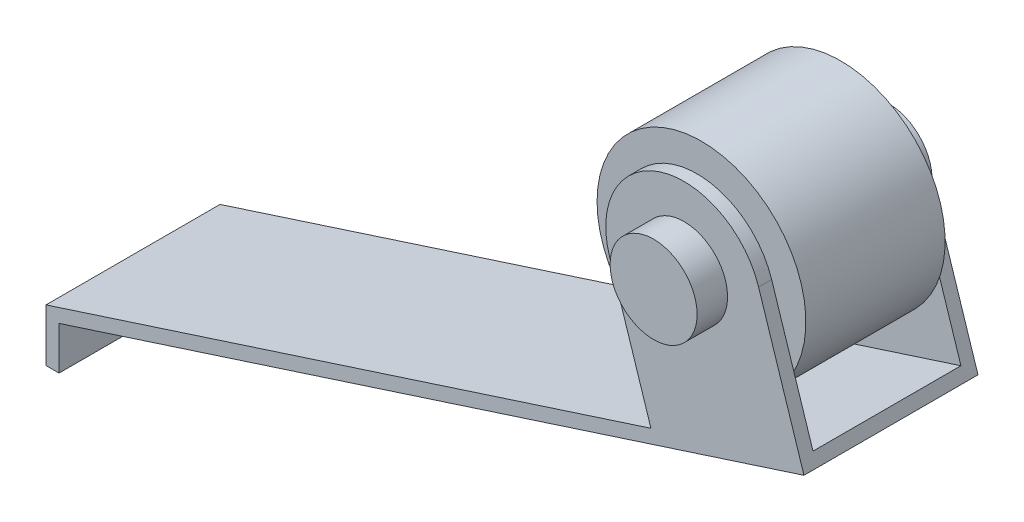
ISO-10303-21;
HEADER;
FILE_DESCRIPTION(('STEP AP214'),'2;1');
FILE_NAME('part.step','',(''),(''),'','','');
FILE_SCHEMA(('AUTOMOTIVE_DESIGN { 1 0 10303 214 1 1 1 1 }'));
ENDSEC;
DATA;
#1=APPLICATION_CONTEXT('core data for automotive mechanical design processes');
#2=APPLICATION_PROTOCOL_DEFINITION('international standard','automotive_design',2000,#1);
#3=PRODUCT_CONTEXT('',#1,'mechanical');
#4=PRODUCT('Part','Part','',(#3));
#5=PRODUCT_RELATED_PRODUCT_CATEGORY('part','',(#4));
#6=PRODUCT_DEFINITION_FORMATION('','',#4);
#7=PRODUCT_DEFINITION_CONTEXT('part definition',#1,'design');
#8=PRODUCT_DEFINITION('design','',#6,#7);
#9=PRODUCT_DEFINITION_SHAPE('','',#8);
#10=(LENGTH_UNIT() NAMED_UNIT(*) SI_UNIT(.MILLI.,.METRE.));
#11=(NAMED_UNIT(*) PLANE_ANGLE_UNIT() SI_UNIT($,.RADIAN.));
#12=(NAMED_UNIT(*) SI_UNIT($,.STERADIAN.) SOLID_ANGLE_UNIT());
#13=UNCERTAINTY_MEASURE_WITH_UNIT(LENGTH_MEASURE(1.E-05),#10,'distance_accuracy_value','');
#14=(GEOMETRIC_REPRESENTATION_CONTEXT(3) GLOBAL_UNCERTAINTY_ASSIGNED_CONTEXT((#13)) GLOBAL_UNIT_ASSIGNED_CONTEXT((#10,
#11,#12)) REPRESENTATION_CONTEXT('',''));
#15=CARTESIAN_POINT('',(0.,0.,0.));
#16=DIRECTION('',(0.,0.,1.));
#17=DIRECTION('',(1.,0.,0.));
#18=AXIS2_PLACEMENT_3D('',#15,#16,#17);
#19=CARTESIAN_POINT('',(14.3663156394455,9.2,-2.));
#20=DIRECTION('',(0.,0.,-1.));
#21=DIRECTION('',(-1.,0.,0.));
#22=AXIS2_PLACEMENT_3D('',#19,#20,#21);
#23=PLANE('',#22);
#24=DIRECTION('',(0.,1.,0.));
#25=VECTOR('',#24,1.);
#26=CARTESIAN_POINT('',(0.,0.,-2.));
#27=LINE('',#26,#25);
#28=CARTESIAN_POINT('',(0.,0.,-2.));
#29=VERTEX_POINT('',#28);
#30=CARTESIAN_POINT('',(0.,0.99,-2.));
#31=VERTEX_POINT('',#30);
#32=EDGE_CURVE('E139',#29,#31,#27,.T.);
#33=ORIENTED_EDGE('',*,*,#32,.F.);
#34=DIRECTION('',(1.,0.,0.));
#35=VECTOR('',#34,1.);
#36=CARTESIAN_POINT('',(0.,0.,-2.));
#37=LINE('',#36,#35);
#38=CARTESIAN_POINT('',(-0.3,0.,-2.));
#39=VERTEX_POINT('',#38);
#40=EDGE_CURVE('E158',#39,#29,#37,.T.);
#41=ORIENTED_EDGE('',*,*,#40,.F.);
#42=DIRECTION('',(0.,-1.,0.));
#43=VECTOR('',#42,1.);
#44=CARTESIAN_POINT('',(-0.3,1.20828821372089,-2.));
#45=LINE('',#44,#43);
#46=CARTESIAN_POINT('',(-0.3,1.20828821372089,-2.));
#47=VERTEX_POINT('',#46);
#48=EDGE_CURVE('E156',#47,#39,#45,.T.);
#49=ORIENTED_EDGE('',*,*,#48,.F.);
#50=DIRECTION('',(-0.951494163295912,-0.307666795760955,0.));
#51=VECTOR('',#50,1.);
#52=CARTESIAN_POINT('',(13.6048484329192,5.70443787803314,-2.));
#53=LINE('',#52,#51);
#54=CARTESIAN_POINT('',(13.6048484329192,5.70443787803314,-2.));
#55=VERTEX_POINT('',#54);
#56=EDGE_CURVE('E154',#55,#47,#53,.T.);
#57=ORIENTED_EDGE('',*,*,#56,.F.);
#58=DIRECTION('',(0.307666795760955,-0.951494163295912,0.));
#59=VECTOR('',#58,1.);
#60=CARTESIAN_POINT('',(13.6048484329192,5.70443787803314,-2.));
#61=LINE('',#60,#59);
#62=CARTESIAN_POINT('',(12.6536261455129,8.64619976763028,-2.));
#63=VERTEX_POINT('',#62);
#64=EDGE_CURVE('E151',#63,#55,#61,.T.);
#65=ORIENTED_EDGE('',*,*,#64,.F.);
#66=CARTESIAN_POINT('',(14.3663156394455,9.2,-2.));
#67=DIRECTION('',(0.,0.,1.));
#68=DIRECTION('',(-1.,0.,0.));
#69=AXIS2_PLACEMENT_3D('',#66,#67,#68);
#70=CIRCLE('',#69,1.8);
#71=CARTESIAN_POINT('',(16.0790051333782,9.75380023236972,-2.));
#72=VERTEX_POINT('',#71);
#73=EDGE_CURVE('E148',#72,#63,#70,.T.);
#74=ORIENTED_EDGE('',*,*,#73,.F.);
#75=DIRECTION('',(-0.307666795760956,0.951494163295912,0.));
#76=VECTOR('',#75,1.);
#77=CARTESIAN_POINT('',(16.0790051333782,9.75380023236972,-2.));
#78=LINE('',#77,#76);
#79=CARTESIAN_POINT('',(17.1225274595128,6.5265900937838,-2.));
#80=VERTEX_POINT('',#79);
#81=EDGE_CURVE('E146',#80,#72,#78,.T.);
#82=ORIENTED_EDGE('',*,*,#81,.F.);
#83=DIRECTION('',(0.951494163295912,0.307666795760955,0.));
#84=VECTOR('',#83,1.);
#85=CARTESIAN_POINT('',(0.,0.99,-2.));
#86=LINE('',#85,#84);
#87=EDGE_CURVE('E144',#31,#80,#86,.T.);
#88=ORIENTED_EDGE('',*,*,#87,.F.);
#89=EDGE_LOOP('',(#33,#41,#49,#57,#65,#74,#82,#88));
#90=FACE_BOUND('',#89,.T.);
#91=CARTESIAN_POINT('',(14.3663156394455,9.2,-2.));
#92=DIRECTION('',(0.,0.,-1.));
#93=DIRECTION('',(-1.,0.,0.));
#94=AXIS2_PLACEMENT_3D('',#91,#92,#93);
#95=CIRCLE('',#94,1.);
#96=CARTESIAN_POINT('',(13.3663156394455,9.2,-2.));
#97=VERTEX_POINT('',#96);
#98=EDGE_CURVE('E217',#97,#97,#95,.F.);
#99=ORIENTED_EDGE('',*,*,#98,.T.);
#100=EDGE_LOOP('',(#99));
#101=FACE_BOUND('',#100,.T.);
#102=ADVANCED_FACE('F17',(#90,#101),#23,.T.);
#103=CARTESIAN_POINT('',(14.3663156394455,9.2,-1.7));
#104=DIRECTION('',(0.,0.,-1.));
#105=DIRECTION('',(-1.,0.,0.));
#106=AXIS2_PLACEMENT_3D('',#103,#104,#105);
#107=PLANE('',#106);
#108=DIRECTION('',(0.307666795760955,-0.951494163295912,0.));
#109=VECTOR('',#108,1.);
#110=CARTESIAN_POINT('',(12.6536261455129,8.64619976763028,-1.7));
#111=LINE('',#110,#109);
#112=CARTESIAN_POINT('',(12.6536261455129,8.64619976763028,-1.7));
#113=VERTEX_POINT('',#112);
#114=CARTESIAN_POINT('',(13.6048484329192,5.70443787803314,-1.7));
#115=VERTEX_POINT('',#114);
#116=EDGE_CURVE('E34',#113,#115,#111,.T.);
#117=ORIENTED_EDGE('',*,*,#116,.T.);
#118=DIRECTION('',(0.951494163295912,0.307666795760955,0.));
#119=VECTOR('',#118,1.);
#120=CARTESIAN_POINT('',(17.0302274207844,6.81203834277258,-1.7));
#121=LINE('',#120,#119);
#122=CARTESIAN_POINT('',(17.0302274207844,6.81203834277258,-1.7));
#123=VERTEX_POINT('',#122);
#124=EDGE_CURVE('E111',#115,#123,#121,.T.);
#125=ORIENTED_EDGE('',*,*,#124,.T.);
#126=DIRECTION('',(-0.307666795760955,0.951494163295912,0.));
#127=VECTOR('',#126,1.);
#128=CARTESIAN_POINT('',(17.0302274207844,6.81203834277258,-1.7));
#129=LINE('',#128,#127);
#130=CARTESIAN_POINT('',(16.0790051333782,9.75380023236972,-1.7));
#131=VERTEX_POINT('',#130);
#132=EDGE_CURVE('E123',#123,#131,#129,.T.);
#133=ORIENTED_EDGE('',*,*,#132,.T.);
#134=CARTESIAN_POINT('',(14.3663156394455,9.2,-1.7));
#135=DIRECTION('',(0.,0.,-1.));
#136=DIRECTION('',(-1.,0.,0.));
#137=AXIS2_PLACEMENT_3D('',#134,#135,#136);
#138=CIRCLE('',#137,1.8);
#139=EDGE_CURVE('E130',#131,#113,#138,.F.);
#140=ORIENTED_EDGE('',*,*,#139,.T.);
#141=EDGE_LOOP('',(#117,#125,#133,#140));
#142=FACE_BOUND('',#141,.T.);
#143=CARTESIAN_POINT('',(14.3663156394455,9.2,-1.7));
#144=DIRECTION('',(0.,0.,-1.));
#145=DIRECTION('',(-1.,0.,0.));
#146=AXIS2_PLACEMENT_3D('',#143,#144,#145);
#147=CIRCLE('',#146,1.);
#148=CARTESIAN_POINT('',(13.3663156394455,9.2,-1.7));
#149=VERTEX_POINT('',#148);
#150=EDGE_CURVE('E11',#149,#149,#147,.F.);
#151=ORIENTED_EDGE('',*,*,#150,.F.);
#152=EDGE_LOOP('',(#151));
#153=FACE_BOUND('',#152,.T.);
#154=ADVANCED_FACE('F121',(#142,#153),#107,.F.);
#155=CARTESIAN_POINT('',(14.3663156394455,9.2,-1.6));
#156=DIRECTION('',(0.,0.,-1.));
#157=DIRECTION('',(-1.,0.,0.));
#158=AXIS2_PLACEMENT_3D('',#155,#156,#157);
#159=PLANE('',#158);
#160=CARTESIAN_POINT('',(14.3663156394455,9.2,-1.6));
#161=DIRECTION('',(0.,0.,-1.));
#162=DIRECTION('',(-1.,0.,0.));
#163=AXIS2_PLACEMENT_3D('',#160,#161,#162);
#164=CIRCLE('',#163,2.4);
#165=CARTESIAN_POINT('',(11.9663156394455,9.2,-1.6));
#166=VERTEX_POINT('',#165);
#167=EDGE_CURVE('E211',#166,#166,#164,.T.);
#168=ORIENTED_EDGE('',*,*,#167,.T.);
#169=EDGE_LOOP('',(#168));
#170=FACE_BOUND('',#169,.T.);
#171=CARTESIAN_POINT('',(14.3663156394455,9.2,-1.6));
#172=DIRECTION('',(0.,0.,-1.));
#173=DIRECTION('',(-1.,0.,0.));
#174=AXIS2_PLACEMENT_3D('',#171,#172,#173);
#175=CIRCLE('',#174,1.);
#176=CARTESIAN_POINT('',(13.3663156394455,9.2,-1.6));
#177=VERTEX_POINT('',#176);
#178=EDGE_CURVE('E223',#177,#177,#175,.T.);
#179=ORIENTED_EDGE('',*,*,#178,.F.);
#180=EDGE_LOOP('',(#179));
#181=FACE_BOUND('',#180,.T.);
#182=ADVANCED_FACE('F230',(#170,#181),#159,.T.);
#183=CARTESIAN_POINT('',(14.3663156394455,9.2,2.));
#184=DIRECTION('',(0.,0.,-1.));
#185=DIRECTION('',(-1.,0.,0.));
#186=AXIS2_PLACEMENT_3D('',#183,#184,#185);
#187=PLANE('',#186);
#188=DIRECTION('',(0.,1.,0.));
#189=VECTOR('',#188,1.);
#190=CARTESIAN_POINT('',(0.,0.,2.));
#191=LINE('',#190,#189);
#192=CARTESIAN_POINT('',(0.,0.,2.));
#193=VERTEX_POINT('',#192);
#194=CARTESIAN_POINT('',(0.,0.99,2.));
#195=VERTEX_POINT('',#194);
#196=EDGE_CURVE('E160',#193,#195,#191,.T.);
#197=ORIENTED_EDGE('',*,*,#196,.T.);
#198=DIRECTION('',(0.951494163295912,0.307666795760955,0.));
#199=VECTOR('',#198,1.);
#200=CARTESIAN_POINT('',(0.,0.99,2.));
#201=LINE('',#200,#199);
#202=CARTESIAN_POINT('',(17.1225274595128,6.5265900937838,2.));
#203=VERTEX_POINT('',#202);
#204=EDGE_CURVE('E162',#195,#203,#201,.T.);
#205=ORIENTED_EDGE('',*,*,#204,.T.);
#206=DIRECTION('',(-0.307666795760956,0.951494163295912,0.));
#207=VECTOR('',#206,1.);
#208=CARTESIAN_POINT('',(16.0790051333782,9.75380023236972,2.));
#209=LINE('',#208,#207);
#210=CARTESIAN_POINT('',(16.0790051333782,9.75380023236972,2.));
#211=VERTEX_POINT('',#210);
#212=EDGE_CURVE('E164',#203,#211,#209,.T.);
#213=ORIENTED_EDGE('',*,*,#212,.T.);
#214=CARTESIAN_POINT('',(14.3663156394455,9.2,2.));
#215=DIRECTION('',(0.,0.,1.));
#216=DIRECTION('',(-1.,0.,0.));
#217=AXIS2_PLACEMENT_3D('',#214,#215,#216);
#218=CIRCLE('',#217,1.8);
#219=CARTESIAN_POINT('',(12.6536261455129,8.64619976763028,2.));
#220=VERTEX_POINT('',#219);
#221=EDGE_CURVE('E166',#211,#220,#218,.T.);
#222=ORIENTED_EDGE('',*,*,#221,.T.);
#223=DIRECTION('',(0.307666795760955,-0.951494163295912,0.));
#224=VECTOR('',#223,1.);
#225=CARTESIAN_POINT('',(13.6048484329192,5.70443787803314,2.));
#226=LINE('',#225,#224);
#227=CARTESIAN_POINT('',(13.6048484329192,5.70443787803314,2.));
#228=VERTEX_POINT('',#227);
#229=EDGE_CURVE('E168',#220,#228,#226,.T.);
#230=ORIENTED_EDGE('',*,*,#229,.T.);
#231=DIRECTION('',(-0.951494163295912,-0.307666795760955,0.));
#232=VECTOR('',#231,1.);
#233=CARTESIAN_POINT('',(13.6048484329192,5.70443787803314,2.));
#234=LINE('',#233,#232);
#235=CARTESIAN_POINT('',(-0.3,1.20828821372089,2.));
#236=VERTEX_POINT('',#235);
#237=EDGE_CURVE('E170',#228,#236,#234,.T.);
#238=ORIENTED_EDGE('',*,*,#237,.T.);
#239=DIRECTION('',(0.,-1.,0.));
#240=VECTOR('',#239,1.);
#241=CARTESIAN_POINT('',(-0.3,1.20828821372089,2.));
#242=LINE('',#241,#240);
#243=CARTESIAN_POINT('',(-0.3,0.,2.));
#244=VERTEX_POINT('',#243);
#245=EDGE_CURVE('E172',#236,#244,#242,.T.);
#246=ORIENTED_EDGE('',*,*,#245,.T.);
#247=DIRECTION('',(1.,0.,0.));
#248=VECTOR('',#247,1.);
#249=CARTESIAN_POINT('',(0.,0.,2.));
#250=LINE('',#249,#248);
#251=EDGE_CURVE('E42',#244,#193,#250,.T.);
#252=ORIENTED_EDGE('',*,*,#251,.T.);
#253=EDGE_LOOP('',(#197,#205,#213,#222,#230,#238,#246,#252));
#254=FACE_BOUND('',#253,.T.);
#255=CARTESIAN_POINT('',(14.3663156394455,9.2,2.));
#256=DIRECTION('',(0.,0.,-1.));
#257=DIRECTION('',(-1.,0.,0.));
#258=AXIS2_PLACEMENT_3D('',#255,#256,#257);
#259=CIRCLE('',#258,1.);
#260=CARTESIAN_POINT('',(13.3663156394455,9.2,2.));
#261=VERTEX_POINT('',#260);
#262=EDGE_CURVE('E26',#261,#261,#259,.F.);
#263=ORIENTED_EDGE('',*,*,#262,.F.);
#264=EDGE_LOOP('',(#263));
#265=FACE_BOUND('',#264,.T.);
#266=ADVANCED_FACE('F232',(#254,#265),#187,.F.);
#267=CARTESIAN_POINT('',(14.3663156394455,9.2,1.7));
#268=DIRECTION('',(0.,0.,-1.));
#269=DIRECTION('',(-1.,0.,0.));
#270=AXIS2_PLACEMENT_3D('',#267,#268,#269);
#271=PLANE('',#270);
#272=DIRECTION('',(-0.951494163295912,-0.307666795760955,0.));
#273=VECTOR('',#272,1.);
#274=CARTESIAN_POINT('',(17.0302274207844,6.81203834277258,1.7));
#275=LINE('',#274,#273);
#276=CARTESIAN_POINT('',(17.0302274207844,6.81203834277258,1.7));
#277=VERTEX_POINT('',#276);
#278=CARTESIAN_POINT('',(13.6048484329192,5.70443787803314,1.7));
#279=VERTEX_POINT('',#278);
#280=EDGE_CURVE('E114',#277,#279,#275,.T.);
#281=ORIENTED_EDGE('',*,*,#280,.T.);
#282=DIRECTION('',(-0.307666795760955,0.951494163295912,0.));
#283=VECTOR('',#282,1.);
#284=CARTESIAN_POINT('',(12.6536261455129,8.64619976763028,1.7));
#285=LINE('',#284,#283);
#286=CARTESIAN_POINT('',(12.6536261455129,8.64619976763028,1.7));
#287=VERTEX_POINT('',#286);
#288=EDGE_CURVE('E138',#279,#287,#285,.T.);
#289=ORIENTED_EDGE('',*,*,#288,.T.);
#290=CARTESIAN_POINT('',(14.3663156394455,9.2,1.7));
#291=DIRECTION('',(0.,0.,-1.));
#292=DIRECTION('',(-1.,0.,0.));
#293=AXIS2_PLACEMENT_3D('',#290,#291,#292);
#294=CIRCLE('',#293,1.8);
#295=CARTESIAN_POINT('',(16.0790051333782,9.75380023236972,1.7));
#296=VERTEX_POINT('',#295);
#297=EDGE_CURVE('E119',#287,#296,#294,.T.);
#298=ORIENTED_EDGE('',*,*,#297,.T.);
#299=DIRECTION('',(0.307666795760955,-0.951494163295912,0.));
#300=VECTOR('',#299,1.);
#301=CARTESIAN_POINT('',(17.0302274207844,6.81203834277258,1.7));
#302=LINE('',#301,#300);
#303=EDGE_CURVE('E135',#296,#277,#302,.T.);
#304=ORIENTED_EDGE('',*,*,#303,.T.);
#305=EDGE_LOOP('',(#281,#289,#298,#304));
#306=FACE_BOUND('',#305,.T.);
#307=CARTESIAN_POINT('',(14.3663156394455,9.2,1.7));
#308=DIRECTION('',(0.,0.,-1.));
#309=DIRECTION('',(-1.,0.,0.));
#310=AXIS2_PLACEMENT_3D('',#307,#308,#309);
#311=CIRCLE('',#310,1.);
#312=CARTESIAN_POINT('',(13.3663156394455,9.2,1.7));
#313=VERTEX_POINT('',#312);
#314=EDGE_CURVE('E21',#313,#313,#311,.F.);
#315=ORIENTED_EDGE('',*,*,#314,.T.);
#316=EDGE_LOOP('',(#315));
#317=FACE_BOUND('',#316,.T.);
#318=ADVANCED_FACE('F240',(#306,#317),#271,.T.);
#319=CARTESIAN_POINT('',(16.0790051333782,9.75380023236972,2.));
#320=DIRECTION('',(-0.951494163295912,-0.307666795760956,0.));
#321=DIRECTION('',(0.307666795760956,-0.951494163295912,0.));
#322=AXIS2_PLACEMENT_3D('',#319,#320,#321);
#323=PLANE('',#322);
#324=ORIENTED_EDGE('',*,*,#303,.F.);
#325=DIRECTION('',(0.,0.,-1.));
#326=VECTOR('',#325,1.);
#327=CARTESIAN_POINT('',(16.0790051333782,9.75380023236972,2.));
#328=LINE('',#327,#326);
#329=EDGE_CURVE('E191',#211,#296,#328,.T.);
#330=ORIENTED_EDGE('',*,*,#329,.F.);
#331=ORIENTED_EDGE('',*,*,#212,.F.);
#332=DIRECTION('',(0.,0.,-1.));
#333=VECTOR('',#332,1.);
#334=CARTESIAN_POINT('',(17.1225274595128,6.5265900937838,2.));
#335=LINE('',#334,#333);
#336=EDGE_CURVE('E194',#203,#80,#335,.T.);
#337=ORIENTED_EDGE('',*,*,#336,.T.);
#338=ORIENTED_EDGE('',*,*,#81,.T.);
#339=EDGE_CURVE('E129',#131,#72,#328,.T.);
#340=ORIENTED_EDGE('',*,*,#339,.F.);
#341=ORIENTED_EDGE('',*,*,#132,.F.);
#342=DIRECTION('',(0.,0.,-1.));
#343=VECTOR('',#342,1.);
#344=CARTESIAN_POINT('',(17.0302274207844,6.81203834277258,8.92600076372985));
#345=LINE('',#344,#343);
#346=EDGE_CURVE('E109',#277,#123,#345,.T.);
#347=ORIENTED_EDGE('',*,*,#346,.F.);
#348=EDGE_LOOP('',(#324,#330,#331,#337,#338,#340,#341,#347));
#349=FACE_BOUND('',#348,.T.);
#350=ADVANCED_FACE('F127',(#349),#323,.F.);
#351=CARTESIAN_POINT('',(14.3663156394455,9.2,2.));
#352=DIRECTION('',(0.,0.,-1.));
#353=DIRECTION('',(-1.,0.,0.));
#354=AXIS2_PLACEMENT_3D('',#351,#352,#353);
#355=CYLINDRICAL_SURFACE('',#354,1.8);
#356=ORIENTED_EDGE('',*,*,#297,.F.);
#357=DIRECTION('',(0.,0.,-1.));
#358=VECTOR('',#357,1.);
#359=CARTESIAN_POINT('',(12.6536261455129,8.64619976763028,2.));
#360=LINE('',#359,#358);
#361=EDGE_CURVE('E188',#220,#287,#360,.T.);
#362=ORIENTED_EDGE('',*,*,#361,.F.);
#363=ORIENTED_EDGE('',*,*,#221,.F.);
#364=ORIENTED_EDGE('',*,*,#329,.T.);
#365=EDGE_LOOP('',(#356,#362,#363,#364));
#366=FACE_BOUND('',#365,.T.);
#367=ADVANCED_FACE('F275',(#366),#355,.T.);
#368=CARTESIAN_POINT('',(13.6048484329192,5.70443787803314,2.));
#369=DIRECTION('',(0.951494163295912,0.307666795760955,0.));
#370=DIRECTION('',(-0.307666795760955,0.951494163295912,0.));
#371=AXIS2_PLACEMENT_3D('',#368,#369,#370);
#372=PLANE('',#371);
#373=ORIENTED_EDGE('',*,*,#288,.F.);
#374=DIRECTION('',(0.,0.,-1.));
#375=VECTOR('',#374,1.);
#376=CARTESIAN_POINT('',(13.6048484329192,5.70443787803314,2.));
#377=LINE('',#376,#375);
#378=EDGE_CURVE('E185',#228,#279,#377,.T.);
#379=ORIENTED_EDGE('',*,*,#378,.F.);
#380=ORIENTED_EDGE('',*,*,#229,.F.);
#381=ORIENTED_EDGE('',*,*,#361,.T.);
#382=EDGE_LOOP('',(#373,#379,#380,#381));
#383=FACE_BOUND('',#382,.T.);
#384=ADVANCED_FACE('F270',(#383),#372,.F.);
#385=CARTESIAN_POINT('',(0.,0.,2.));
#386=DIRECTION('',(-1.,0.,0.));
#387=DIRECTION('',(0.,0.,1.));
#388=AXIS2_PLACEMENT_3D('',#385,#386,#387);
#389=PLANE('',#388);
#390=ORIENTED_EDGE('',*,*,#32,.T.);
#391=DIRECTION('',(0.,0.,-1.));
#392=VECTOR('',#391,1.);
#393=CARTESIAN_POINT('',(0.,0.99,2.));
#394=LINE('',#393,#392);
#395=EDGE_CURVE('E196',#195,#31,#394,.T.);
#396=ORIENTED_EDGE('',*,*,#395,.F.);
#397=ORIENTED_EDGE('',*,*,#196,.F.);
#398=DIRECTION('',(0.,0.,-1.));
#399=VECTOR('',#398,1.);
#400=CARTESIAN_POINT('',(0.,0.,2.));
#401=LINE('',#400,#399);
#402=EDGE_CURVE('E175',#193,#29,#401,.T.);
#403=ORIENTED_EDGE('',*,*,#402,.T.);
#404=EDGE_LOOP('',(#390,#396,#397,#403));
#405=FACE_BOUND('',#404,.T.);
#406=ADVANCED_FACE('F19',(#405),#389,.F.);
#407=CARTESIAN_POINT('',(0.,0.99,2.));
#408=DIRECTION('',(-0.307666795760955,0.951494163295912,0.));
#409=DIRECTION('',(-0.951494163295912,-0.307666795760955,0.));
#410=AXIS2_PLACEMENT_3D('',#407,#408,#409);
#411=PLANE('',#410);
#412=ORIENTED_EDGE('',*,*,#87,.T.);
#413=ORIENTED_EDGE('',*,*,#336,.F.);
#414=ORIENTED_EDGE('',*,*,#204,.F.);
#415=ORIENTED_EDGE('',*,*,#395,.T.);
#416=EDGE_LOOP('',(#412,#413,#414,#415));
#417=FACE_BOUND('',#416,.T.);
#418=ADVANCED_FACE('F273',(#417),#411,.F.);
#419=EDGE_CURVE('E187',#113,#63,#360,.T.);
#420=ORIENTED_EDGE('',*,*,#419,.F.);
#421=ORIENTED_EDGE('',*,*,#139,.F.);
#422=ORIENTED_EDGE('',*,*,#339,.T.);
#423=ORIENTED_EDGE('',*,*,#73,.T.);
#424=EDGE_LOOP('',(#420,#421,#422,#423));
#425=FACE_BOUND('',#424,.T.);
#426=ADVANCED_FACE('F268',(#425),#355,.T.);
#427=EDGE_CURVE('E184',#115,#55,#377,.T.);
#428=ORIENTED_EDGE('',*,*,#427,.F.);
#429=ORIENTED_EDGE('',*,*,#116,.F.);
#430=ORIENTED_EDGE('',*,*,#419,.T.);
#431=ORIENTED_EDGE('',*,*,#64,.T.);
#432=EDGE_LOOP('',(#428,#429,#430,#431));
#433=FACE_BOUND('',#432,.T.);
#434=ADVANCED_FACE('F265',(#433),#372,.F.);
#435=CARTESIAN_POINT('',(13.6048484329192,5.70443787803314,2.));
#436=DIRECTION('',(0.307666795760955,-0.951494163295912,0.));
#437=DIRECTION('',(0.951494163295912,0.307666795760955,0.));
#438=AXIS2_PLACEMENT_3D('',#435,#436,#437);
#439=PLANE('',#438);
#440=ORIENTED_EDGE('',*,*,#56,.T.);
#441=DIRECTION('',(0.,0.,-1.));
#442=VECTOR('',#441,1.);
#443=CARTESIAN_POINT('',(-0.3,1.20828821372089,2.));
#444=LINE('',#443,#442);
#445=EDGE_CURVE('E181',#236,#47,#444,.T.);
#446=ORIENTED_EDGE('',*,*,#445,.F.);
#447=ORIENTED_EDGE('',*,*,#237,.F.);
#448=ORIENTED_EDGE('',*,*,#378,.T.);
#449=ORIENTED_EDGE('',*,*,#280,.F.);
#450=ORIENTED_EDGE('',*,*,#346,.T.);
#451=ORIENTED_EDGE('',*,*,#124,.F.);
#452=ORIENTED_EDGE('',*,*,#427,.T.);
#453=EDGE_LOOP('',(#440,#446,#447,#448,#449,#450,#451,#452));
#454=FACE_BOUND('',#453,.T.);
#455=ADVANCED_FACE('F110',(#454),#439,.F.);
#456=CARTESIAN_POINT('',(-0.3,1.20828821372089,2.));
#457=DIRECTION('',(1.,0.,0.));
#458=DIRECTION('',(0.,1.,0.));
#459=AXIS2_PLACEMENT_3D('',#456,#457,#458);
#460=PLANE('',#459);
#461=ORIENTED_EDGE('',*,*,#48,.T.);
#462=DIRECTION('',(0.,0.,-1.));
#463=VECTOR('',#462,1.);
#464=CARTESIAN_POINT('',(-0.3,0.,2.));
#465=LINE('',#464,#463);
#466=EDGE_CURVE('E178',#244,#39,#465,.T.);
#467=ORIENTED_EDGE('',*,*,#466,.F.);
#468=ORIENTED_EDGE('',*,*,#245,.F.);
#469=ORIENTED_EDGE('',*,*,#445,.T.);
#470=EDGE_LOOP('',(#461,#467,#468,#469));
#471=FACE_BOUND('',#470,.T.);
#472=ADVANCED_FACE('F258',(#471),#460,.F.);
#473=CARTESIAN_POINT('',(0.,0.,2.));
#474=DIRECTION('',(0.,1.,0.));
#475=DIRECTION('',(0.,0.,1.));
#476=AXIS2_PLACEMENT_3D('',#473,#474,#475);
#477=PLANE('',#476);
#478=ORIENTED_EDGE('',*,*,#40,.T.);
#479=ORIENTED_EDGE('',*,*,#402,.F.);
#480=ORIENTED_EDGE('',*,*,#251,.F.);
#481=ORIENTED_EDGE('',*,*,#466,.T.);
#482=EDGE_LOOP('',(#478,#479,#480,#481));
#483=FACE_BOUND('',#482,.T.);
#484=ADVANCED_FACE('F254',(#483),#477,.F.);
#485=CARTESIAN_POINT('',(14.3663156394455,9.2,2.7));
#486=DIRECTION('',(0.,0.,-1.));
#487=DIRECTION('',(-1.,0.,0.));
#488=AXIS2_PLACEMENT_3D('',#485,#486,#487);
#489=CYLINDRICAL_SURFACE('',#488,1.);
#490=ORIENTED_EDGE('',*,*,#314,.F.);
#491=EDGE_LOOP('',(#490));
#492=FACE_BOUND('',#491,.T.);
#493=CARTESIAN_POINT('',(14.3663156394455,9.2,1.6));
#494=DIRECTION('',(0.,0.,-1.));
#495=DIRECTION('',(-1.,0.,0.));
#496=AXIS2_PLACEMENT_3D('',#493,#494,#495);
#497=CIRCLE('',#496,1.);
#498=CARTESIAN_POINT('',(13.3663156394455,9.2,1.6));
#499=VERTEX_POINT('',#498);
#500=EDGE_CURVE('E208',#499,#499,#497,.T.);
#501=ORIENTED_EDGE('',*,*,#500,.F.);
#502=EDGE_LOOP('',(#501));
#503=FACE_BOUND('',#502,.T.);
#504=ADVANCED_FACE('F257',(#492,#503),#489,.T.);
#505=CARTESIAN_POINT('',(14.3663156394455,9.2,2.7));
#506=DIRECTION('',(0.,0.,1.));
#507=DIRECTION('',(1.,0.,0.));
#508=AXIS2_PLACEMENT_3D('',#505,#506,#507);
#509=CIRCLE('',#508,1.);
#510=CARTESIAN_POINT('',(15.3663156394455,9.2,2.7));
#511=VERTEX_POINT('',#510);
#512=EDGE_CURVE('E205',#511,#511,#509,.T.);
#513=ORIENTED_EDGE('',*,*,#512,.F.);
#514=EDGE_LOOP('',(#513));
#515=FACE_BOUND('',#514,.T.);
#516=ORIENTED_EDGE('',*,*,#262,.T.);
#517=EDGE_LOOP('',(#516));
#518=FACE_BOUND('',#517,.T.);
#519=ADVANCED_FACE('F314',(#515,#518),#489,.T.);
#520=CARTESIAN_POINT('',(14.3663156394455,9.2,2.7));
#521=DIRECTION('',(0.,0.,1.));
#522=DIRECTION('',(1.,0.,0.));
#523=AXIS2_PLACEMENT_3D('',#520,#521,#522);
#524=PLANE('',#523);
#525=ORIENTED_EDGE('',*,*,#512,.T.);
#526=EDGE_LOOP('',(#525));
#527=FACE_BOUND('',#526,.T.);
#528=ADVANCED_FACE('F321',(#527),#524,.T.);
#529=CARTESIAN_POINT('',(14.3663156394455,9.2,1.6));
#530=DIRECTION('',(0.,0.,-1.));
#531=DIRECTION('',(-1.,0.,0.));
#532=AXIS2_PLACEMENT_3D('',#529,#530,#531);
#533=PLANE('',#532);
#534=CARTESIAN_POINT('',(14.3663156394455,9.2,1.6));
#535=DIRECTION('',(0.,0.,-1.));
#536=DIRECTION('',(-1.,0.,0.));
#537=AXIS2_PLACEMENT_3D('',#534,#535,#536);
#538=CIRCLE('',#537,2.4);
#539=CARTESIAN_POINT('',(11.9663156394455,9.2,1.6));
#540=VERTEX_POINT('',#539);
#541=EDGE_CURVE('E214',#540,#540,#538,.T.);
#542=ORIENTED_EDGE('',*,*,#541,.F.);
#543=EDGE_LOOP('',(#542));
#544=FACE_BOUND('',#543,.T.);
#545=ORIENTED_EDGE('',*,*,#500,.T.);
#546=EDGE_LOOP('',(#545));
#547=FACE_BOUND('',#546,.T.);
#548=ADVANCED_FACE('F318',(#544,#547),#533,.F.);
#549=CARTESIAN_POINT('',(14.3663156394455,9.2,-1.6));
#550=DIRECTION('',(0.,0.,1.));
#551=DIRECTION('',(1.,0.,0.));
#552=AXIS2_PLACEMENT_3D('',#549,#550,#551);
#553=CYLINDRICAL_SURFACE('',#552,2.4);
#554=ORIENTED_EDGE('',*,*,#167,.F.);
#555=EDGE_LOOP('',(#554));
#556=FACE_BOUND('',#555,.T.);
#557=ORIENTED_EDGE('',*,*,#541,.T.);
#558=EDGE_LOOP('',(#557));
#559=FACE_BOUND('',#558,.T.);
#560=ADVANCED_FACE('F320',(#556,#559),#553,.T.);
#561=CARTESIAN_POINT('',(14.3663156394455,9.2,-2.7));
#562=DIRECTION('',(0.,0.,1.));
#563=DIRECTION('',(1.,0.,0.));
#564=AXIS2_PLACEMENT_3D('',#561,#562,#563);
#565=CYLINDRICAL_SURFACE('',#564,1.);
#566=ORIENTED_EDGE('',*,*,#178,.T.);
#567=EDGE_LOOP('',(#566));
#568=FACE_BOUND('',#567,.T.);
#569=ORIENTED_EDGE('',*,*,#150,.T.);
#570=EDGE_LOOP('',(#569));
#571=FACE_BOUND('',#570,.T.);
#572=ADVANCED_FACE('F227',(#568,#571),#565,.T.);
#573=ORIENTED_EDGE('',*,*,#98,.F.);
#574=EDGE_LOOP('',(#573));
#575=FACE_BOUND('',#574,.T.);
#576=CARTESIAN_POINT('',(14.3663156394455,9.2,-2.7));
#577=DIRECTION('',(0.,0.,-1.));
#578=DIRECTION('',(-1.,0.,0.));
#579=AXIS2_PLACEMENT_3D('',#576,#577,#578);
#580=CIRCLE('',#579,1.);
#581=CARTESIAN_POINT('',(13.3663156394455,9.2,-2.7));
#582=VERTEX_POINT('',#581);
#583=EDGE_CURVE('E219',#582,#582,#580,.T.);
#584=ORIENTED_EDGE('',*,*,#583,.F.);
#585=EDGE_LOOP('',(#584));
#586=FACE_BOUND('',#585,.T.);
#587=ADVANCED_FACE('F332',(#575,#586),#565,.T.);
#588=CARTESIAN_POINT('',(14.3663156394455,9.2,-2.7));
#589=DIRECTION('',(0.,0.,-1.));
#590=DIRECTION('',(-1.,0.,0.));
#591=AXIS2_PLACEMENT_3D('',#588,#589,#590);
#592=PLANE('',#591);
#593=ORIENTED_EDGE('',*,*,#583,.T.);
#594=EDGE_LOOP('',(#593));
#595=FACE_BOUND('',#594,.T.);
#596=ADVANCED_FACE('F335',(#595),#592,.T.);
#597=CLOSED_SHELL('',(#102,#154,#182,#266,#318,#350,#367,#384,#406,#418,#426,#434,#455,#472,
#484,#504,#519,#528,#548,#560,#572,#587,#596));
#598=MANIFOLD_SOLID_BREP('B1',#597);
#599=ADVANCED_BREP_SHAPE_REPRESENTATION('',(#18,#598),#14);
#600=SHAPE_DEFINITION_REPRESENTATION(#9,#599);
ENDSEC;
END-ISO-10303-21;
